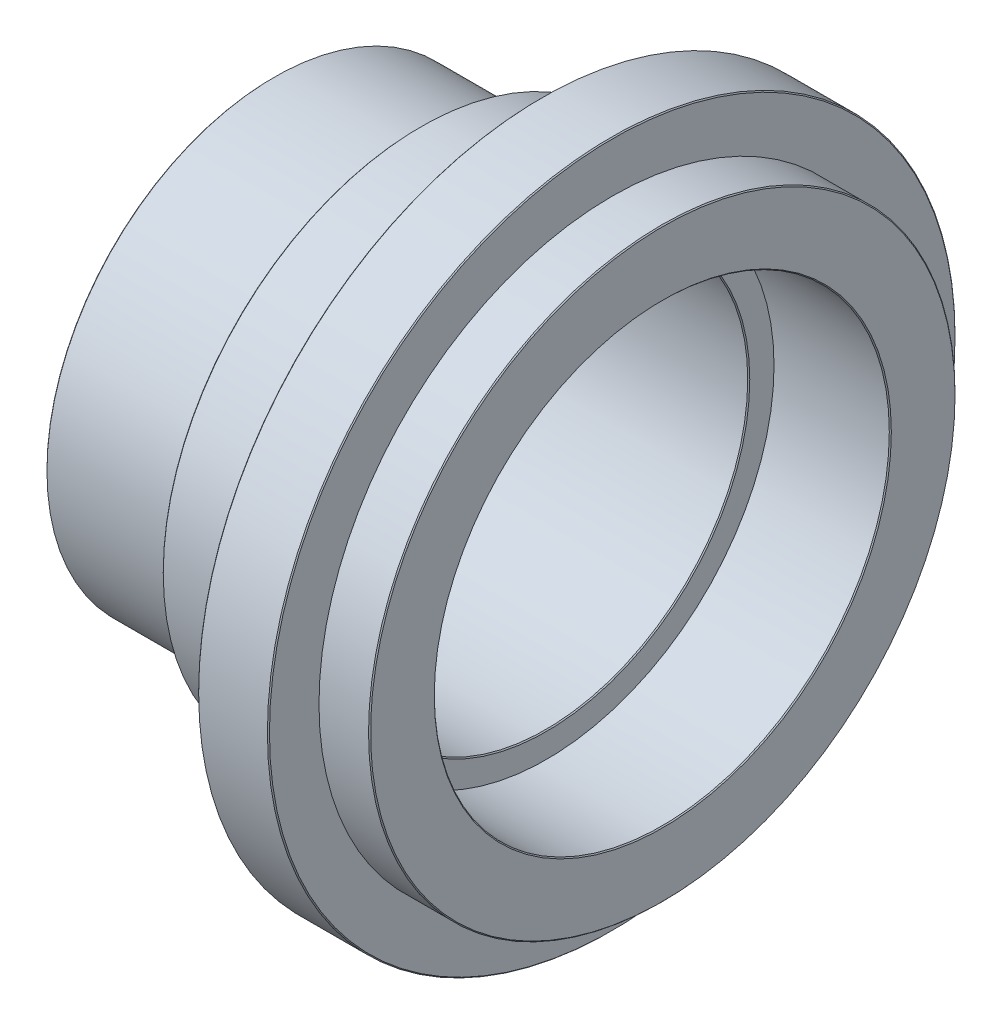
ISO-10303-21;
HEADER;
FILE_DESCRIPTION(('STEP AP214'),'2;1');
FILE_NAME('part.step','',(''),(''),'','','');
FILE_SCHEMA(('AUTOMOTIVE_DESIGN { 1 0 10303 214 1 1 1 1 }'));
ENDSEC;
DATA;
#1=APPLICATION_CONTEXT('core data for automotive mechanical design processes');
#2=APPLICATION_PROTOCOL_DEFINITION('international standard','automotive_design',2000,#1);
#3=PRODUCT_CONTEXT('',#1,'mechanical');
#4=PRODUCT('Part','Part','',(#3));
#5=PRODUCT_RELATED_PRODUCT_CATEGORY('part','',(#4));
#6=PRODUCT_DEFINITION_FORMATION('','',#4);
#7=PRODUCT_DEFINITION_CONTEXT('part definition',#1,'design');
#8=PRODUCT_DEFINITION('design','',#6,#7);
#9=PRODUCT_DEFINITION_SHAPE('','',#8);
#10=(LENGTH_UNIT() NAMED_UNIT(*) SI_UNIT(.MILLI.,.METRE.));
#11=(NAMED_UNIT(*) PLANE_ANGLE_UNIT() SI_UNIT($,.RADIAN.));
#12=(NAMED_UNIT(*) SI_UNIT($,.STERADIAN.) SOLID_ANGLE_UNIT());
#13=UNCERTAINTY_MEASURE_WITH_UNIT(LENGTH_MEASURE(1.E-05),#10,'distance_accuracy_value','');
#14=(GEOMETRIC_REPRESENTATION_CONTEXT(3) GLOBAL_UNCERTAINTY_ASSIGNED_CONTEXT((#13)) GLOBAL_UNIT_ASSIGNED_CONTEXT((#10,
#11,#12)) REPRESENTATION_CONTEXT('',''));
#15=CARTESIAN_POINT('',(0.,0.,0.));
#16=DIRECTION('',(0.,0.,1.));
#17=DIRECTION('',(1.,0.,0.));
#18=AXIS2_PLACEMENT_3D('',#15,#16,#17);
#19=CARTESIAN_POINT('',(0.,0.,0.));
#20=DIRECTION('',(1.,0.,0.));
#21=DIRECTION('',(0.,0.,-1.));
#22=AXIS2_PLACEMENT_3D('',#19,#20,#21);
#23=CYLINDRICAL_SURFACE('',#22,58.);
#24=CARTESIAN_POINT('',(-0.200000000000025,0.,0.));
#25=DIRECTION('',(1.,0.,0.));
#26=DIRECTION('',(0.,0.,-1.));
#27=AXIS2_PLACEMENT_3D('',#24,#25,#26);
#28=CIRCLE('',#27,58.);
#29=CARTESIAN_POINT('',(-0.200000000000025,0.,-58.));
#30=VERTEX_POINT('',#29);
#31=EDGE_CURVE('E75',#30,#30,#28,.F.);
#32=ORIENTED_EDGE('',*,*,#31,.T.);
#33=EDGE_LOOP('',(#32));
#34=FACE_BOUND('',#33,.T.);
#35=CARTESIAN_POINT('',(-10.,0.,0.));
#36=DIRECTION('',(1.,0.,0.));
#37=DIRECTION('',(0.,0.,-1.));
#38=AXIS2_PLACEMENT_3D('',#35,#36,#37);
#39=CIRCLE('',#38,58.);
#40=CARTESIAN_POINT('',(-10.,0.,-58.));
#41=VERTEX_POINT('',#40);
#42=EDGE_CURVE('E99',#41,#41,#39,.T.);
#43=ORIENTED_EDGE('',*,*,#42,.T.);
#44=EDGE_LOOP('',(#43));
#45=FACE_BOUND('',#44,.T.);
#46=ADVANCED_FACE('F31',(#34,#45),#23,.T.);
#47=CARTESIAN_POINT('',(0.,45.,0.));
#48=DIRECTION('',(1.,0.,0.));
#49=DIRECTION('',(0.,0.,-1.));
#50=AXIS2_PLACEMENT_3D('',#47,#48,#49);
#51=PLANE('',#50);
#52=CARTESIAN_POINT('',(0.,0.,0.));
#53=DIRECTION('',(1.,0.,0.));
#54=DIRECTION('',(0.,0.,-1.));
#55=AXIS2_PLACEMENT_3D('',#52,#53,#54);
#56=CIRCLE('',#55,45.2000000000001);
#57=CARTESIAN_POINT('',(0.,0.,-45.2000000000001));
#58=VERTEX_POINT('',#57);
#59=EDGE_CURVE('E78',#58,#58,#56,.F.);
#60=ORIENTED_EDGE('',*,*,#59,.T.);
#61=EDGE_LOOP('',(#60));
#62=FACE_BOUND('',#61,.T.);
#63=CARTESIAN_POINT('',(0.,0.,0.));
#64=DIRECTION('',(1.,0.,0.));
#65=DIRECTION('',(0.,0.,-1.));
#66=AXIS2_PLACEMENT_3D('',#63,#64,#65);
#67=CIRCLE('',#66,57.8);
#68=CARTESIAN_POINT('',(0.,0.,-57.8));
#69=VERTEX_POINT('',#68);
#70=EDGE_CURVE('E81',#69,#69,#67,.T.);
#71=ORIENTED_EDGE('',*,*,#70,.T.);
#72=EDGE_LOOP('',(#71));
#73=FACE_BOUND('',#72,.T.);
#74=ADVANCED_FACE('F121',(#62,#73),#51,.T.);
#75=CARTESIAN_POINT('',(0.,0.,0.));
#76=DIRECTION('',(1.,0.,0.));
#77=DIRECTION('',(0.,0.,-1.));
#78=AXIS2_PLACEMENT_3D('',#75,#76,#77);
#79=CYLINDRICAL_SURFACE('',#78,45.);
#80=CARTESIAN_POINT('',(-0.200000000000073,0.,0.));
#81=DIRECTION('',(1.,0.,0.));
#82=DIRECTION('',(0.,0.,-1.));
#83=AXIS2_PLACEMENT_3D('',#80,#81,#82);
#84=CIRCLE('',#83,45.);
#85=CARTESIAN_POINT('',(-0.200000000000073,0.,-45.));
#86=VERTEX_POINT('',#85);
#87=EDGE_CURVE('E84',#86,#86,#84,.T.);
#88=ORIENTED_EDGE('',*,*,#87,.T.);
#89=EDGE_LOOP('',(#88));
#90=FACE_BOUND('',#89,.T.);
#91=CARTESIAN_POINT('',(-23.,0.,0.));
#92=DIRECTION('',(1.,0.,0.));
#93=DIRECTION('',(0.,0.,-1.));
#94=AXIS2_PLACEMENT_3D('',#91,#92,#93);
#95=CIRCLE('',#94,45.);
#96=CARTESIAN_POINT('',(-23.,0.,-45.));
#97=VERTEX_POINT('',#96);
#98=EDGE_CURVE('E87',#97,#97,#95,.T.);
#99=ORIENTED_EDGE('',*,*,#98,.F.);
#100=EDGE_LOOP('',(#99));
#101=FACE_BOUND('',#100,.T.);
#102=ADVANCED_FACE('F127',(#90,#101),#79,.F.);
#103=CARTESIAN_POINT('',(-23.,40.,0.));
#104=DIRECTION('',(1.,0.,0.));
#105=DIRECTION('',(0.,0.,-1.));
#106=AXIS2_PLACEMENT_3D('',#103,#104,#105);
#107=PLANE('',#106);
#108=CARTESIAN_POINT('',(-23.,0.,0.));
#109=DIRECTION('',(1.,0.,0.));
#110=DIRECTION('',(0.,0.,-1.));
#111=AXIS2_PLACEMENT_3D('',#108,#109,#110);
#112=CIRCLE('',#111,40.2);
#113=CARTESIAN_POINT('',(-23.,0.,-40.2));
#114=VERTEX_POINT('',#113);
#115=EDGE_CURVE('E10',#114,#114,#112,.F.);
#116=ORIENTED_EDGE('',*,*,#115,.T.);
#117=EDGE_LOOP('',(#116));
#118=FACE_BOUND('',#117,.T.);
#119=ORIENTED_EDGE('',*,*,#98,.T.);
#120=EDGE_LOOP('',(#119));
#121=FACE_BOUND('',#120,.T.);
#122=ADVANCED_FACE('F187',(#118,#121),#107,.T.);
#123=CARTESIAN_POINT('',(0.,0.,0.));
#124=DIRECTION('',(1.,0.,0.));
#125=DIRECTION('',(0.,0.,-1.));
#126=AXIS2_PLACEMENT_3D('',#123,#124,#125);
#127=CYLINDRICAL_SURFACE('',#126,40.);
#128=CARTESIAN_POINT('',(-23.2,0.,0.));
#129=DIRECTION('',(1.,0.,0.));
#130=DIRECTION('',(0.,0.,-1.));
#131=AXIS2_PLACEMENT_3D('',#128,#129,#130);
#132=CIRCLE('',#131,40.);
#133=CARTESIAN_POINT('',(-23.2,0.,-40.));
#134=VERTEX_POINT('',#133);
#135=EDGE_CURVE('E38',#134,#134,#132,.T.);
#136=ORIENTED_EDGE('',*,*,#135,.T.);
#137=EDGE_LOOP('',(#136));
#138=FACE_BOUND('',#137,.T.);
#139=CARTESIAN_POINT('',(-76.8,0.,0.));
#140=DIRECTION('',(-1.,0.,0.));
#141=DIRECTION('',(0.,0.,1.));
#142=AXIS2_PLACEMENT_3D('',#139,#140,#141);
#143=CIRCLE('',#142,40.);
#144=CARTESIAN_POINT('',(-76.8,0.,40.));
#145=VERTEX_POINT('',#144);
#146=EDGE_CURVE('E46',#145,#145,#143,.T.);
#147=ORIENTED_EDGE('',*,*,#146,.T.);
#148=EDGE_LOOP('',(#147));
#149=FACE_BOUND('',#148,.T.);
#150=ADVANCED_FACE('F183',(#138,#149),#127,.F.);
#151=CARTESIAN_POINT('',(-77.,45.,0.));
#152=DIRECTION('',(-1.,0.,0.));
#153=DIRECTION('',(0.,0.,1.));
#154=AXIS2_PLACEMENT_3D('',#151,#152,#153);
#155=PLANE('',#154);
#156=CARTESIAN_POINT('',(-77.,0.,0.));
#157=DIRECTION('',(-1.,0.,0.));
#158=DIRECTION('',(0.,0.,1.));
#159=AXIS2_PLACEMENT_3D('',#156,#157,#158);
#160=CIRCLE('',#159,40.2);
#161=CARTESIAN_POINT('',(-77.,0.,40.2));
#162=VERTEX_POINT('',#161);
#163=EDGE_CURVE('E51',#162,#162,#160,.F.);
#164=ORIENTED_EDGE('',*,*,#163,.T.);
#165=EDGE_LOOP('',(#164));
#166=FACE_BOUND('',#165,.T.);
#167=CARTESIAN_POINT('',(-77.,0.,0.));
#168=DIRECTION('',(-1.,0.,0.));
#169=DIRECTION('',(0.,0.,1.));
#170=AXIS2_PLACEMENT_3D('',#167,#168,#169);
#171=CIRCLE('',#170,44.8);
#172=CARTESIAN_POINT('',(-77.,0.,44.8));
#173=VERTEX_POINT('',#172);
#174=EDGE_CURVE('E54',#173,#173,#171,.T.);
#175=ORIENTED_EDGE('',*,*,#174,.T.);
#176=EDGE_LOOP('',(#175));
#177=FACE_BOUND('',#176,.T.);
#178=ADVANCED_FACE('F165',(#166,#177),#155,.T.);
#179=CARTESIAN_POINT('',(0.,0.,0.));
#180=DIRECTION('',(1.,0.,0.));
#181=DIRECTION('',(0.,0.,-1.));
#182=AXIS2_PLACEMENT_3D('',#179,#180,#181);
#183=CYLINDRICAL_SURFACE('',#182,45.);
#184=CARTESIAN_POINT('',(-76.8,0.,0.));
#185=DIRECTION('',(-1.,0.,0.));
#186=DIRECTION('',(0.,0.,1.));
#187=AXIS2_PLACEMENT_3D('',#184,#185,#186);
#188=CIRCLE('',#187,45.);
#189=CARTESIAN_POINT('',(-76.8,0.,45.));
#190=VERTEX_POINT('',#189);
#191=EDGE_CURVE('E42',#190,#190,#188,.F.);
#192=ORIENTED_EDGE('',*,*,#191,.T.);
#193=EDGE_LOOP('',(#192));
#194=FACE_BOUND('',#193,.T.);
#195=CARTESIAN_POINT('',(-48.,0.,0.));
#196=DIRECTION('',(1.,0.,0.));
#197=DIRECTION('',(0.,0.,-1.));
#198=AXIS2_PLACEMENT_3D('',#195,#196,#197);
#199=CIRCLE('',#198,45.);
#200=CARTESIAN_POINT('',(-48.,0.,-45.));
#201=VERTEX_POINT('',#200);
#202=EDGE_CURVE('E90',#201,#201,#199,.T.);
#203=ORIENTED_EDGE('',*,*,#202,.F.);
#204=EDGE_LOOP('',(#203));
#205=FACE_BOUND('',#204,.T.);
#206=ADVANCED_FACE('F161',(#194,#205),#183,.T.);
#207=CARTESIAN_POINT('',(-48.,51.,0.));
#208=DIRECTION('',(-1.,0.,0.));
#209=DIRECTION('',(0.,0.,1.));
#210=AXIS2_PLACEMENT_3D('',#207,#208,#209);
#211=PLANE('',#210);
#212=CARTESIAN_POINT('',(-48.,0.,0.));
#213=DIRECTION('',(-1.,0.,0.));
#214=DIRECTION('',(0.,0.,1.));
#215=AXIS2_PLACEMENT_3D('',#212,#213,#214);
#216=CIRCLE('',#215,50.8);
#217=CARTESIAN_POINT('',(-48.,0.,50.8));
#218=VERTEX_POINT('',#217);
#219=EDGE_CURVE('E57',#218,#218,#216,.T.);
#220=ORIENTED_EDGE('',*,*,#219,.T.);
#221=EDGE_LOOP('',(#220));
#222=FACE_BOUND('',#221,.T.);
#223=ORIENTED_EDGE('',*,*,#202,.T.);
#224=EDGE_LOOP('',(#223));
#225=FACE_BOUND('',#224,.T.);
#226=ADVANCED_FACE('F164',(#222,#225),#211,.T.);
#227=CARTESIAN_POINT('',(0.,0.,0.));
#228=DIRECTION('',(1.,0.,0.));
#229=DIRECTION('',(0.,0.,-1.));
#230=AXIS2_PLACEMENT_3D('',#227,#228,#229);
#231=CYLINDRICAL_SURFACE('',#230,51.);
#232=CARTESIAN_POINT('',(-47.8,0.,0.));
#233=DIRECTION('',(-1.,0.,0.));
#234=DIRECTION('',(0.,0.,1.));
#235=AXIS2_PLACEMENT_3D('',#232,#233,#234);
#236=CIRCLE('',#235,51.);
#237=CARTESIAN_POINT('',(-47.8,0.,51.));
#238=VERTEX_POINT('',#237);
#239=EDGE_CURVE('E60',#238,#238,#236,.F.);
#240=ORIENTED_EDGE('',*,*,#239,.T.);
#241=EDGE_LOOP('',(#240));
#242=FACE_BOUND('',#241,.T.);
#243=CARTESIAN_POINT('',(-27.,0.,0.));
#244=DIRECTION('',(1.,0.,0.));
#245=DIRECTION('',(0.,0.,-1.));
#246=AXIS2_PLACEMENT_3D('',#243,#244,#245);
#247=CIRCLE('',#246,51.);
#248=CARTESIAN_POINT('',(-27.,0.,-51.));
#249=VERTEX_POINT('',#248);
#250=EDGE_CURVE('E93',#249,#249,#247,.T.);
#251=ORIENTED_EDGE('',*,*,#250,.F.);
#252=EDGE_LOOP('',(#251));
#253=FACE_BOUND('',#252,.T.);
#254=ADVANCED_FACE('F170',(#242,#253),#231,.T.);
#255=CARTESIAN_POINT('',(-24.,0.,0.));
#256=DIRECTION('',(1.,0.,0.));
#257=DIRECTION('',(0.,0.,-1.));
#258=AXIS2_PLACEMENT_3D('',#255,#256,#257);
#259=CONICAL_SURFACE('',#258,56.1961524227066,1.0471975511966);
#260=ORIENTED_EDGE('',*,*,#250,.T.);
#261=EDGE_LOOP('',(#260));
#262=FACE_BOUND('',#261,.T.);
#263=CARTESIAN_POINT('',(-24.,0.,0.));
#264=DIRECTION('',(1.,0.,0.));
#265=DIRECTION('',(0.,0.,-1.));
#266=AXIS2_PLACEMENT_3D('',#263,#264,#265);
#267=CIRCLE('',#266,56.1961524227066);
#268=CARTESIAN_POINT('',(-24.,0.,-56.1961524227066));
#269=VERTEX_POINT('',#268);
#270=EDGE_CURVE('E96',#269,#269,#267,.T.);
#271=ORIENTED_EDGE('',*,*,#270,.F.);
#272=EDGE_LOOP('',(#271));
#273=FACE_BOUND('',#272,.T.);
#274=ADVANCED_FACE('F176',(#262,#273),#259,.T.);
#275=CARTESIAN_POINT('',(-24.,68.,0.));
#276=DIRECTION('',(-1.,0.,0.));
#277=DIRECTION('',(0.,0.,1.));
#278=AXIS2_PLACEMENT_3D('',#275,#276,#277);
#279=PLANE('',#278);
#280=CARTESIAN_POINT('',(-24.,0.,0.));
#281=DIRECTION('',(-1.,0.,0.));
#282=DIRECTION('',(0.,0.,1.));
#283=AXIS2_PLACEMENT_3D('',#280,#281,#282);
#284=CIRCLE('',#283,67.8);
#285=CARTESIAN_POINT('',(-24.,0.,67.8));
#286=VERTEX_POINT('',#285);
#287=EDGE_CURVE('E63',#286,#286,#284,.T.);
#288=ORIENTED_EDGE('',*,*,#287,.T.);
#289=EDGE_LOOP('',(#288));
#290=FACE_BOUND('',#289,.T.);
#291=ORIENTED_EDGE('',*,*,#270,.T.);
#292=EDGE_LOOP('',(#291));
#293=FACE_BOUND('',#292,.T.);
#294=ADVANCED_FACE('F117',(#290,#293),#279,.T.);
#295=CARTESIAN_POINT('',(0.,0.,0.));
#296=DIRECTION('',(1.,0.,0.));
#297=DIRECTION('',(0.,0.,-1.));
#298=AXIS2_PLACEMENT_3D('',#295,#296,#297);
#299=CYLINDRICAL_SURFACE('',#298,68.);
#300=CARTESIAN_POINT('',(-10.2,0.,0.));
#301=DIRECTION('',(1.,0.,0.));
#302=DIRECTION('',(0.,0.,-1.));
#303=AXIS2_PLACEMENT_3D('',#300,#301,#302);
#304=CIRCLE('',#303,68.);
#305=CARTESIAN_POINT('',(-10.2,0.,-68.));
#306=VERTEX_POINT('',#305);
#307=EDGE_CURVE('E66',#306,#306,#304,.F.);
#308=ORIENTED_EDGE('',*,*,#307,.T.);
#309=EDGE_LOOP('',(#308));
#310=FACE_BOUND('',#309,.T.);
#311=CARTESIAN_POINT('',(-23.8,0.,0.));
#312=DIRECTION('',(-1.,0.,0.));
#313=DIRECTION('',(0.,0.,1.));
#314=AXIS2_PLACEMENT_3D('',#311,#312,#313);
#315=CIRCLE('',#314,68.);
#316=CARTESIAN_POINT('',(-23.8,0.,68.));
#317=VERTEX_POINT('',#316);
#318=EDGE_CURVE('E69',#317,#317,#315,.F.);
#319=ORIENTED_EDGE('',*,*,#318,.T.);
#320=EDGE_LOOP('',(#319));
#321=FACE_BOUND('',#320,.T.);
#322=ADVANCED_FACE('F107',(#310,#321),#299,.T.);
#323=CARTESIAN_POINT('',(-10.,58.,0.));
#324=DIRECTION('',(1.,0.,0.));
#325=DIRECTION('',(0.,0.,-1.));
#326=AXIS2_PLACEMENT_3D('',#323,#324,#325);
#327=PLANE('',#326);
#328=CARTESIAN_POINT('',(-10.,0.,0.));
#329=DIRECTION('',(1.,0.,0.));
#330=DIRECTION('',(0.,0.,-1.));
#331=AXIS2_PLACEMENT_3D('',#328,#329,#330);
#332=CIRCLE('',#331,67.8);
#333=CARTESIAN_POINT('',(-10.,0.,-67.8));
#334=VERTEX_POINT('',#333);
#335=EDGE_CURVE('E72',#334,#334,#332,.T.);
#336=ORIENTED_EDGE('',*,*,#335,.T.);
#337=EDGE_LOOP('',(#336));
#338=FACE_BOUND('',#337,.T.);
#339=ORIENTED_EDGE('',*,*,#42,.F.);
#340=EDGE_LOOP('',(#339));
#341=FACE_BOUND('',#340,.T.);
#342=ADVANCED_FACE('F104',(#338,#341),#327,.T.);
#343=CARTESIAN_POINT('',(-0.200000000000073,0.,0.));
#344=DIRECTION('',(1.,0.,0.));
#345=DIRECTION('',(0.,0.,-1.));
#346=AXIS2_PLACEMENT_3D('',#343,#344,#345);
#347=CONICAL_SURFACE('',#346,45.,0.785398163397466);
#348=ORIENTED_EDGE('',*,*,#59,.F.);
#349=EDGE_LOOP('',(#348));
#350=FACE_BOUND('',#349,.T.);
#351=ORIENTED_EDGE('',*,*,#87,.F.);
#352=EDGE_LOOP('',(#351));
#353=FACE_BOUND('',#352,.T.);
#354=ADVANCED_FACE('F106',(#350,#353),#347,.F.);
#355=CARTESIAN_POINT('',(0.,0.,0.));
#356=DIRECTION('',(-1.,0.,0.));
#357=DIRECTION('',(0.,0.,1.));
#358=AXIS2_PLACEMENT_3D('',#355,#356,#357);
#359=CONICAL_SURFACE('',#358,57.8,0.785398163397448);
#360=ORIENTED_EDGE('',*,*,#31,.F.);
#361=EDGE_LOOP('',(#360));
#362=FACE_BOUND('',#361,.T.);
#363=ORIENTED_EDGE('',*,*,#70,.F.);
#364=EDGE_LOOP('',(#363));
#365=FACE_BOUND('',#364,.T.);
#366=ADVANCED_FACE('F114',(#362,#365),#359,.T.);
#367=CARTESIAN_POINT('',(-10.,0.,0.));
#368=DIRECTION('',(-1.,0.,0.));
#369=DIRECTION('',(0.,0.,1.));
#370=AXIS2_PLACEMENT_3D('',#367,#368,#369);
#371=CONICAL_SURFACE('',#370,67.8,0.785398163397552);
#372=ORIENTED_EDGE('',*,*,#307,.F.);
#373=EDGE_LOOP('',(#372));
#374=FACE_BOUND('',#373,.T.);
#375=ORIENTED_EDGE('',*,*,#335,.F.);
#376=EDGE_LOOP('',(#375));
#377=FACE_BOUND('',#376,.T.);
#378=ADVANCED_FACE('F134',(#374,#377),#371,.T.);
#379=CARTESIAN_POINT('',(-23.8,0.,0.));
#380=DIRECTION('',(1.,0.,0.));
#381=DIRECTION('',(0.,0.,-1.));
#382=AXIS2_PLACEMENT_3D('',#379,#380,#381);
#383=CONICAL_SURFACE('',#382,68.,0.785398163397448);
#384=ORIENTED_EDGE('',*,*,#287,.F.);
#385=EDGE_LOOP('',(#384));
#386=FACE_BOUND('',#385,.T.);
#387=ORIENTED_EDGE('',*,*,#318,.F.);
#388=EDGE_LOOP('',(#387));
#389=FACE_BOUND('',#388,.T.);
#390=ADVANCED_FACE('F138',(#386,#389),#383,.T.);
#391=CARTESIAN_POINT('',(-47.8,0.,0.));
#392=DIRECTION('',(1.,0.,0.));
#393=DIRECTION('',(0.,0.,-1.));
#394=AXIS2_PLACEMENT_3D('',#391,#392,#393);
#395=CONICAL_SURFACE('',#394,51.,0.785398163397431);
#396=ORIENTED_EDGE('',*,*,#219,.F.);
#397=EDGE_LOOP('',(#396));
#398=FACE_BOUND('',#397,.T.);
#399=ORIENTED_EDGE('',*,*,#239,.F.);
#400=EDGE_LOOP('',(#399));
#401=FACE_BOUND('',#400,.T.);
#402=ADVANCED_FACE('F142',(#398,#401),#395,.T.);
#403=CARTESIAN_POINT('',(-77.,0.,0.));
#404=DIRECTION('',(-1.,0.,0.));
#405=DIRECTION('',(0.,0.,1.));
#406=AXIS2_PLACEMENT_3D('',#403,#404,#405);
#407=CONICAL_SURFACE('',#406,40.2,0.785398163397483);
#408=ORIENTED_EDGE('',*,*,#146,.F.);
#409=EDGE_LOOP('',(#408));
#410=FACE_BOUND('',#409,.T.);
#411=ORIENTED_EDGE('',*,*,#163,.F.);
#412=EDGE_LOOP('',(#411));
#413=FACE_BOUND('',#412,.T.);
#414=ADVANCED_FACE('F146',(#410,#413),#407,.F.);
#415=CARTESIAN_POINT('',(-76.8,0.,0.));
#416=DIRECTION('',(1.,0.,0.));
#417=DIRECTION('',(0.,0.,-1.));
#418=AXIS2_PLACEMENT_3D('',#415,#416,#417);
#419=CONICAL_SURFACE('',#418,45.,0.785398163397518);
#420=ORIENTED_EDGE('',*,*,#174,.F.);
#421=EDGE_LOOP('',(#420));
#422=FACE_BOUND('',#421,.T.);
#423=ORIENTED_EDGE('',*,*,#191,.F.);
#424=EDGE_LOOP('',(#423));
#425=FACE_BOUND('',#424,.T.);
#426=ADVANCED_FACE('F149',(#422,#425),#419,.T.);
#427=CARTESIAN_POINT('',(-23.2,0.,0.));
#428=DIRECTION('',(1.,0.,0.));
#429=DIRECTION('',(0.,0.,-1.));
#430=AXIS2_PLACEMENT_3D('',#427,#428,#429);
#431=CONICAL_SURFACE('',#430,40.,0.785398163397448);
#432=ORIENTED_EDGE('',*,*,#115,.F.);
#433=EDGE_LOOP('',(#432));
#434=FACE_BOUND('',#433,.T.);
#435=ORIENTED_EDGE('',*,*,#135,.F.);
#436=EDGE_LOOP('',(#435));
#437=FACE_BOUND('',#436,.T.);
#438=ADVANCED_FACE('F33',(#434,#437),#431,.F.);
#439=CLOSED_SHELL('',(#46,#74,#102,#122,#150,#178,#206,#226,#254,#274,#294,#322,#342,#354,#366,
#378,#390,#402,#414,#426,#438));
#440=MANIFOLD_SOLID_BREP('B2',#439);
#441=ADVANCED_BREP_SHAPE_REPRESENTATION('',(#18,#440),#14);
#442=SHAPE_DEFINITION_REPRESENTATION(#9,#441);
ENDSEC;
END-ISO-10303-21;
